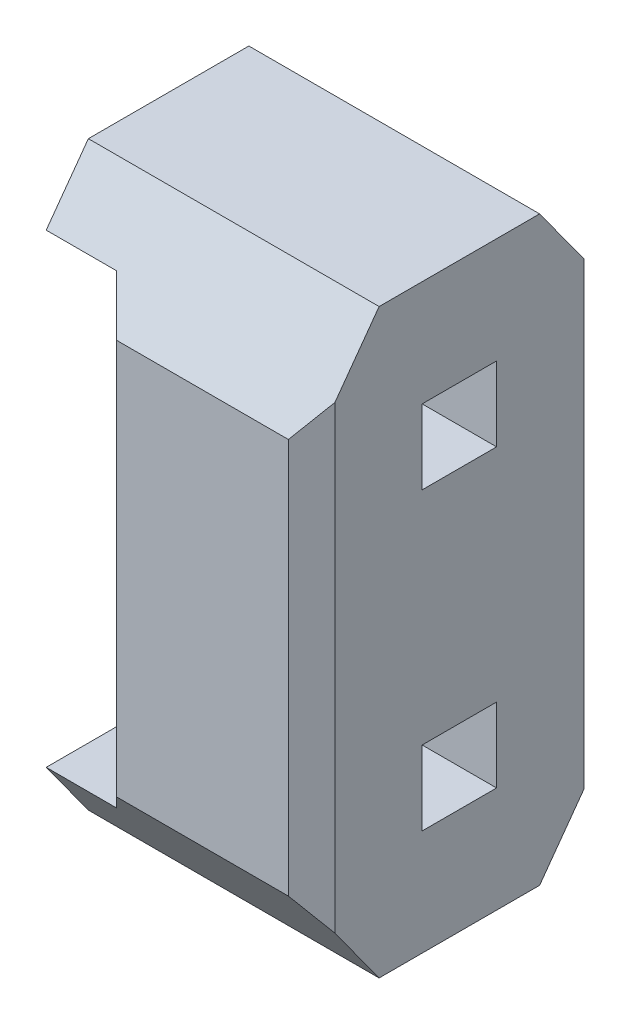
ISO-10303-21;
HEADER;
FILE_DESCRIPTION(('STEP AP214'),'2;1');
FILE_NAME('part.step','',(''),(''),'','','');
FILE_SCHEMA(('AUTOMOTIVE_DESIGN { 1 0 10303 214 1 1 1 1 }'));
ENDSEC;
DATA;
#1=APPLICATION_CONTEXT('core data for automotive mechanical design processes');
#2=APPLICATION_PROTOCOL_DEFINITION('international standard','automotive_design',2000,#1);
#3=PRODUCT_CONTEXT('',#1,'mechanical');
#4=PRODUCT('Part','Part','',(#3));
#5=PRODUCT_RELATED_PRODUCT_CATEGORY('part','',(#4));
#6=PRODUCT_DEFINITION_FORMATION('','',#4);
#7=PRODUCT_DEFINITION_CONTEXT('part definition',#1,'design');
#8=PRODUCT_DEFINITION('design','',#6,#7);
#9=PRODUCT_DEFINITION_SHAPE('','',#8);
#10=(LENGTH_UNIT() NAMED_UNIT(*) SI_UNIT(.MILLI.,.METRE.));
#11=(NAMED_UNIT(*) PLANE_ANGLE_UNIT() SI_UNIT($,.RADIAN.));
#12=(NAMED_UNIT(*) SI_UNIT($,.STERADIAN.) SOLID_ANGLE_UNIT());
#13=UNCERTAINTY_MEASURE_WITH_UNIT(LENGTH_MEASURE(1.E-05),#10,'distance_accuracy_value','');
#14=(GEOMETRIC_REPRESENTATION_CONTEXT(3) GLOBAL_UNCERTAINTY_ASSIGNED_CONTEXT((#13)) GLOBAL_UNIT_ASSIGNED_CONTEXT((#10,
#11,#12)) REPRESENTATION_CONTEXT('',''));
#15=CARTESIAN_POINT('',(0.,0.,0.));
#16=DIRECTION('',(0.,0.,1.));
#17=DIRECTION('',(1.,0.,0.));
#18=AXIS2_PLACEMENT_3D('',#15,#16,#17);
#19=CARTESIAN_POINT('',(1.25,4.6,-46.01));
#20=DIRECTION('',(0.,0.586967571460905,0.809610443394407));
#21=DIRECTION('',(0.,-0.809610443394407,0.586967571460905));
#22=AXIS2_PLACEMENT_3D('',#19,#20,#21);
#23=PLANE('',#22);
#24=DIRECTION('',(1.,0.,0.));
#25=VECTOR('',#24,1.);
#26=CARTESIAN_POINT('',(1.25,4.5,-45.9375));
#27=LINE('',#26,#25);
#28=CARTESIAN_POINT('',(0.,4.5,-45.9375));
#29=VERTEX_POINT('',#28);
#30=CARTESIAN_POINT('',(0.602500000000326,4.5,-45.9375000000001));
#31=VERTEX_POINT('',#30);
#32=EDGE_CURVE('E199',#29,#31,#27,.T.);
#33=ORIENTED_EDGE('',*,*,#32,.T.);
#34=DIRECTION('',(0.50620765634869,-0.698217457033983,0.50620765634961));
#35=VECTOR('',#34,1.);
#36=CARTESIAN_POINT('',(0.6025000000002,4.5,-45.9375));
#37=LINE('',#36,#35);
#38=CARTESIAN_POINT('',(0.819999999999672,4.19999999999999,-45.7199999999999));
#39=VERTEX_POINT('',#38);
#40=EDGE_CURVE('E197',#31,#39,#37,.T.);
#41=ORIENTED_EDGE('',*,*,#40,.T.);
#42=DIRECTION('',(1.,0.,0.));
#43=VECTOR('',#42,1.);
#44=CARTESIAN_POINT('',(1.25,4.19999999999999,-45.72));
#45=LINE('',#44,#43);
#46=CARTESIAN_POINT('',(2.30000000000012,4.19999999999999,-45.7199999999999));
#47=VERTEX_POINT('',#46);
#48=EDGE_CURVE('E20',#39,#47,#45,.T.);
#49=ORIENTED_EDGE('',*,*,#48,.T.);
#50=DIRECTION('',(0.506207656348947,0.69821745703386,-0.506207656349523));
#51=VECTOR('',#50,1.);
#52=CARTESIAN_POINT('',(2.3,4.19999999999999,-45.72));
#53=LINE('',#52,#51);
#54=CARTESIAN_POINT('',(2.49999999999988,4.47586206896592,-45.9200000000002));
#55=VERTEX_POINT('',#54);
#56=EDGE_CURVE('E181',#47,#55,#53,.T.);
#57=ORIENTED_EDGE('',*,*,#56,.T.);
#58=DIRECTION('',(0.,-0.809610443394407,0.586967571460905));
#59=VECTOR('',#58,1.);
#60=CARTESIAN_POINT('',(2.5,4.6,-46.01));
#61=LINE('',#60,#59);
#62=CARTESIAN_POINT('',(2.5,5.,-46.3));
#63=VERTEX_POINT('',#62);
#64=EDGE_CURVE('E188',#55,#63,#61,.F.);
#65=ORIENTED_EDGE('',*,*,#64,.T.);
#66=DIRECTION('',(1.,0.,0.));
#67=VECTOR('',#66,1.);
#68=CARTESIAN_POINT('',(1.25,5.,-46.3));
#69=LINE('',#68,#67);
#70=CARTESIAN_POINT('',(0.,5.,-46.3));
#71=VERTEX_POINT('',#70);
#72=EDGE_CURVE('E215',#71,#63,#69,.T.);
#73=ORIENTED_EDGE('',*,*,#72,.F.);
#74=DIRECTION('',(0.,-0.809610443394407,0.586967571460905));
#75=VECTOR('',#74,1.);
#76=CARTESIAN_POINT('',(0.,4.6,-46.01));
#77=LINE('',#76,#75);
#78=EDGE_CURVE('E207',#71,#29,#77,.T.);
#79=ORIENTED_EDGE('',*,*,#78,.T.);
#80=EDGE_LOOP('',(#33,#41,#49,#57,#65,#73,#79));
#81=FACE_BOUND('',#80,.T.);
#82=ADVANCED_FACE('F17',(#81),#23,.T.);
#83=CARTESIAN_POINT('',(1.25,4.6,-47.97));
#84=DIRECTION('',(0.,-0.586967571460905,0.809610443394407));
#85=DIRECTION('',(0.,-0.809610443394407,-0.586967571460905));
#86=AXIS2_PLACEMENT_3D('',#83,#84,#85);
#87=PLANE('',#86);
#88=DIRECTION('',(0.,-0.809610443394407,-0.586967571460905));
#89=VECTOR('',#88,1.);
#90=CARTESIAN_POINT('',(0.,4.6,-47.97));
#91=LINE('',#90,#89);
#92=CARTESIAN_POINT('',(0.,5.,-47.68));
#93=VERTEX_POINT('',#92);
#94=CARTESIAN_POINT('',(0.,4.5,-48.0425));
#95=VERTEX_POINT('',#94);
#96=EDGE_CURVE('E263',#93,#95,#91,.T.);
#97=ORIENTED_EDGE('',*,*,#96,.F.);
#98=DIRECTION('',(1.,0.,0.));
#99=VECTOR('',#98,1.);
#100=CARTESIAN_POINT('',(1.25,5.,-47.68));
#101=LINE('',#100,#99);
#102=CARTESIAN_POINT('',(2.5,5.,-47.68));
#103=VERTEX_POINT('',#102);
#104=EDGE_CURVE('E227',#103,#93,#101,.F.);
#105=ORIENTED_EDGE('',*,*,#104,.F.);
#106=DIRECTION('',(0.,-0.809610443394407,-0.586967571460905));
#107=VECTOR('',#106,1.);
#108=CARTESIAN_POINT('',(2.5,4.6,-47.97));
#109=LINE('',#108,#107);
#110=CARTESIAN_POINT('',(2.49999999999988,4.47586206896591,-48.0599999999998));
#111=VERTEX_POINT('',#110);
#112=EDGE_CURVE('E223',#111,#103,#109,.F.);
#113=ORIENTED_EDGE('',*,*,#112,.F.);
#114=DIRECTION('',(0.506207656348966,0.698217457033858,0.506207656349507));
#115=VECTOR('',#114,1.);
#116=CARTESIAN_POINT('',(2.3,4.19999999999999,-48.26));
#117=LINE('',#116,#115);
#118=CARTESIAN_POINT('',(2.30000000000012,4.2,-48.2600000000001));
#119=VERTEX_POINT('',#118);
#120=EDGE_CURVE('E266',#119,#111,#117,.T.);
#121=ORIENTED_EDGE('',*,*,#120,.F.);
#122=DIRECTION('',(1.,0.,0.));
#123=VECTOR('',#122,1.);
#124=CARTESIAN_POINT('',(1.25,4.19999999999999,-48.26));
#125=LINE('',#124,#123);
#126=CARTESIAN_POINT('',(0.819999999999671,4.2,-48.2600000000001));
#127=VERTEX_POINT('',#126);
#128=EDGE_CURVE('E205',#127,#119,#125,.T.);
#129=ORIENTED_EDGE('',*,*,#128,.F.);
#130=DIRECTION('',(0.506207656348697,-0.698217457033984,-0.506207656349602));
#131=VECTOR('',#130,1.);
#132=CARTESIAN_POINT('',(0.6025000000002,4.5,-48.0425));
#133=LINE('',#132,#131);
#134=CARTESIAN_POINT('',(0.602500000000324,4.5,-48.0424999999999));
#135=VERTEX_POINT('',#134);
#136=EDGE_CURVE('E203',#135,#127,#133,.T.);
#137=ORIENTED_EDGE('',*,*,#136,.F.);
#138=DIRECTION('',(1.,0.,0.));
#139=VECTOR('',#138,1.);
#140=CARTESIAN_POINT('',(1.25,4.5,-48.0425));
#141=LINE('',#140,#139);
#142=EDGE_CURVE('E261',#95,#135,#141,.T.);
#143=ORIENTED_EDGE('',*,*,#142,.F.);
#144=EDGE_LOOP('',(#97,#105,#113,#121,#129,#137,#143));
#145=FACE_BOUND('',#144,.T.);
#146=ADVANCED_FACE('F285',(#145),#87,.F.);
#147=CARTESIAN_POINT('',(1.25,0.4,-47.97));
#148=DIRECTION('',(0.,0.586967571460905,0.809610443394407));
#149=DIRECTION('',(0.,-0.809610443394407,0.586967571460905));
#150=AXIS2_PLACEMENT_3D('',#147,#148,#149);
#151=PLANE('',#150);
#152=DIRECTION('',(-0.506207656349411,0.698217457033645,-0.506207656349355));
#153=VECTOR('',#152,1.);
#154=CARTESIAN_POINT('',(2.5,0.5241379310345,-48.06));
#155=LINE('',#154,#153);
#156=CARTESIAN_POINT('',(2.49999999999988,0.5241379310345,-48.0599999999999));
#157=VERTEX_POINT('',#156);
#158=CARTESIAN_POINT('',(2.30000000000012,0.800000000000004,-48.2600000000001));
#159=VERTEX_POINT('',#158);
#160=EDGE_CURVE('E251',#157,#159,#155,.T.);
#161=ORIENTED_EDGE('',*,*,#160,.F.);
#162=DIRECTION('',(0.,-0.809610443394407,0.586967571460905));
#163=VECTOR('',#162,1.);
#164=CARTESIAN_POINT('',(2.5,0.4,-47.97));
#165=LINE('',#164,#163);
#166=CARTESIAN_POINT('',(2.5,0.,-47.68));
#167=VERTEX_POINT('',#166);
#168=EDGE_CURVE('E253',#167,#157,#165,.F.);
#169=ORIENTED_EDGE('',*,*,#168,.F.);
#170=DIRECTION('',(1.,0.,0.));
#171=VECTOR('',#170,1.);
#172=CARTESIAN_POINT('',(1.25,0.,-47.68));
#173=LINE('',#172,#171);
#174=CARTESIAN_POINT('',(0.,0.,-47.68));
#175=VERTEX_POINT('',#174);
#176=EDGE_CURVE('E288',#167,#175,#173,.F.);
#177=ORIENTED_EDGE('',*,*,#176,.T.);
#178=DIRECTION('',(0.,-0.809610443394407,0.586967571460905));
#179=VECTOR('',#178,1.);
#180=CARTESIAN_POINT('',(0.,0.4,-47.97));
#181=LINE('',#180,#179);
#182=CARTESIAN_POINT('',(0.,0.5,-48.0425));
#183=VERTEX_POINT('',#182);
#184=EDGE_CURVE('E255',#183,#175,#181,.T.);
#185=ORIENTED_EDGE('',*,*,#184,.F.);
#186=DIRECTION('',(1.,0.,0.));
#187=VECTOR('',#186,1.);
#188=CARTESIAN_POINT('',(1.25,0.500000000000001,-48.0425));
#189=LINE('',#188,#187);
#190=CARTESIAN_POINT('',(0.602500000000324,0.5,-48.0424999999999));
#191=VERTEX_POINT('',#190);
#192=EDGE_CURVE('E257',#191,#183,#189,.F.);
#193=ORIENTED_EDGE('',*,*,#192,.F.);
#194=DIRECTION('',(-0.506207656348696,-0.698217457033985,0.506207656349601));
#195=VECTOR('',#194,1.);
#196=CARTESIAN_POINT('',(0.8199999999998,0.800000000000008,-48.26));
#197=LINE('',#196,#195);
#198=CARTESIAN_POINT('',(0.819999999999671,0.800000000000004,-48.2600000000001));
#199=VERTEX_POINT('',#198);
#200=EDGE_CURVE('E259',#199,#191,#197,.T.);
#201=ORIENTED_EDGE('',*,*,#200,.F.);
#202=DIRECTION('',(1.,0.,0.));
#203=VECTOR('',#202,1.);
#204=CARTESIAN_POINT('',(1.25,0.800000000000008,-48.26));
#205=LINE('',#204,#203);
#206=EDGE_CURVE('E249',#159,#199,#205,.F.);
#207=ORIENTED_EDGE('',*,*,#206,.F.);
#208=EDGE_LOOP('',(#161,#169,#177,#185,#193,#201,#207));
#209=FACE_BOUND('',#208,.T.);
#210=ADVANCED_FACE('F431',(#209),#151,.F.);
#211=CARTESIAN_POINT('',(1.25,0.4,-46.01));
#212=DIRECTION('',(0.,-0.586967571460905,0.809610443394407));
#213=DIRECTION('',(0.,-0.809610443394407,-0.586967571460905));
#214=AXIS2_PLACEMENT_3D('',#211,#212,#213);
#215=PLANE('',#214);
#216=DIRECTION('',(1.,0.,0.));
#217=VECTOR('',#216,1.);
#218=CARTESIAN_POINT('',(1.25,0.800000000000013,-45.72));
#219=LINE('',#218,#217);
#220=CARTESIAN_POINT('',(2.30000000000012,0.800000000000006,-45.7199999999999));
#221=VERTEX_POINT('',#220);
#222=CARTESIAN_POINT('',(0.819999999999672,0.800000000000007,-45.7199999999999));
#223=VERTEX_POINT('',#222);
#224=EDGE_CURVE('E191',#221,#223,#219,.F.);
#225=ORIENTED_EDGE('',*,*,#224,.T.);
#226=DIRECTION('',(-0.50620765634869,-0.698217457033983,-0.50620765634961));
#227=VECTOR('',#226,1.);
#228=CARTESIAN_POINT('',(0.8199999999998,0.800000000000013,-45.72));
#229=LINE('',#228,#227);
#230=CARTESIAN_POINT('',(0.602500000000326,0.500000000000002,-45.9375000000001));
#231=VERTEX_POINT('',#230);
#232=EDGE_CURVE('E232',#223,#231,#229,.T.);
#233=ORIENTED_EDGE('',*,*,#232,.T.);
#234=DIRECTION('',(1.,0.,0.));
#235=VECTOR('',#234,1.);
#236=CARTESIAN_POINT('',(1.25,0.500000000000003,-45.9375));
#237=LINE('',#236,#235);
#238=CARTESIAN_POINT('',(0.,0.500000000000001,-45.9375));
#239=VERTEX_POINT('',#238);
#240=EDGE_CURVE('E246',#231,#239,#237,.F.);
#241=ORIENTED_EDGE('',*,*,#240,.T.);
#242=DIRECTION('',(0.,-0.809610443394407,-0.586967571460905));
#243=VECTOR('',#242,1.);
#244=CARTESIAN_POINT('',(0.,0.4,-46.01));
#245=LINE('',#244,#243);
#246=CARTESIAN_POINT('',(0.,0.,-46.3));
#247=VERTEX_POINT('',#246);
#248=EDGE_CURVE('E244',#239,#247,#245,.T.);
#249=ORIENTED_EDGE('',*,*,#248,.T.);
#250=DIRECTION('',(1.,0.,0.));
#251=VECTOR('',#250,1.);
#252=CARTESIAN_POINT('',(1.25,0.,-46.3));
#253=LINE('',#252,#251);
#254=CARTESIAN_POINT('',(2.5,0.,-46.3));
#255=VERTEX_POINT('',#254);
#256=EDGE_CURVE('E293',#247,#255,#253,.T.);
#257=ORIENTED_EDGE('',*,*,#256,.T.);
#258=DIRECTION('',(0.,-0.809610443394407,-0.586967571460905));
#259=VECTOR('',#258,1.);
#260=CARTESIAN_POINT('',(2.5,0.4,-46.01));
#261=LINE('',#260,#259);
#262=CARTESIAN_POINT('',(2.49999999999988,0.524137931034499,-45.9200000000001));
#263=VERTEX_POINT('',#262);
#264=EDGE_CURVE('E241',#255,#263,#261,.F.);
#265=ORIENTED_EDGE('',*,*,#264,.T.);
#266=DIRECTION('',(-0.5062076563494,0.698217457033649,0.506207656349361));
#267=VECTOR('',#266,1.);
#268=CARTESIAN_POINT('',(2.5,0.524137931034498,-45.92));
#269=LINE('',#268,#267);
#270=EDGE_CURVE('E239',#263,#221,#269,.T.);
#271=ORIENTED_EDGE('',*,*,#270,.T.);
#272=EDGE_LOOP('',(#225,#233,#241,#249,#257,#265,#271));
#273=FACE_BOUND('',#272,.T.);
#274=ADVANCED_FACE('F421',(#273),#215,.T.);
#275=CARTESIAN_POINT('',(1.25,5.,-46.99));
#276=DIRECTION('',(0.,1.,0.));
#277=DIRECTION('',(0.,0.,1.));
#278=AXIS2_PLACEMENT_3D('',#275,#276,#277);
#279=PLANE('',#278);
#280=ORIENTED_EDGE('',*,*,#104,.T.);
#281=DIRECTION('',(0.,0.,-1.));
#282=VECTOR('',#281,1.);
#283=CARTESIAN_POINT('',(0.,5.,-46.99));
#284=LINE('',#283,#282);
#285=EDGE_CURVE('E231',#93,#71,#284,.F.);
#286=ORIENTED_EDGE('',*,*,#285,.T.);
#287=ORIENTED_EDGE('',*,*,#72,.T.);
#288=DIRECTION('',(0.,0.,1.));
#289=VECTOR('',#288,1.);
#290=CARTESIAN_POINT('',(2.5,5.,-46.99));
#291=LINE('',#290,#289);
#292=EDGE_CURVE('E219',#63,#103,#291,.F.);
#293=ORIENTED_EDGE('',*,*,#292,.T.);
#294=EDGE_LOOP('',(#280,#286,#287,#293));
#295=FACE_BOUND('',#294,.T.);
#296=ADVANCED_FACE('F229',(#295),#279,.T.);
#297=CARTESIAN_POINT('',(1.25,0.,-46.99));
#298=DIRECTION('',(0.,1.,0.));
#299=DIRECTION('',(0.,0.,1.));
#300=AXIS2_PLACEMENT_3D('',#297,#298,#299);
#301=PLANE('',#300);
#302=DIRECTION('',(0.,0.,-1.));
#303=VECTOR('',#302,1.);
#304=CARTESIAN_POINT('',(0.,0.,-46.99));
#305=LINE('',#304,#303);
#306=EDGE_CURVE('E297',#247,#175,#305,.T.);
#307=ORIENTED_EDGE('',*,*,#306,.T.);
#308=ORIENTED_EDGE('',*,*,#176,.F.);
#309=DIRECTION('',(0.,0.,1.));
#310=VECTOR('',#309,1.);
#311=CARTESIAN_POINT('',(2.5,0.,-46.99));
#312=LINE('',#311,#310);
#313=EDGE_CURVE('E287',#255,#167,#312,.F.);
#314=ORIENTED_EDGE('',*,*,#313,.F.);
#315=ORIENTED_EDGE('',*,*,#256,.F.);
#316=EDGE_LOOP('',(#307,#308,#314,#315));
#317=FACE_BOUND('',#316,.T.);
#318=ADVANCED_FACE('F428',(#317),#301,.F.);
#319=CARTESIAN_POINT('',(0.,4.75,-46.99));
#320=DIRECTION('',(1.,0.,0.));
#321=DIRECTION('',(0.,0.,-1.));
#322=AXIS2_PLACEMENT_3D('',#319,#320,#321);
#323=PLANE('',#322);
#324=ORIENTED_EDGE('',*,*,#285,.F.);
#325=ORIENTED_EDGE('',*,*,#96,.T.);
#326=DIRECTION('',(0.,0.,1.));
#327=VECTOR('',#326,1.);
#328=CARTESIAN_POINT('',(0.,4.5,-46.99));
#329=LINE('',#328,#327);
#330=EDGE_CURVE('E307',#95,#29,#329,.T.);
#331=ORIENTED_EDGE('',*,*,#330,.T.);
#332=ORIENTED_EDGE('',*,*,#78,.F.);
#333=EDGE_LOOP('',(#324,#325,#331,#332));
#334=FACE_BOUND('',#333,.T.);
#335=ADVANCED_FACE('F441',(#334),#323,.F.);
#336=CARTESIAN_POINT('',(0.,0.25,-46.99));
#337=DIRECTION('',(1.,0.,0.));
#338=DIRECTION('',(0.,0.,-1.));
#339=AXIS2_PLACEMENT_3D('',#336,#337,#338);
#340=PLANE('',#339);
#341=ORIENTED_EDGE('',*,*,#306,.F.);
#342=ORIENTED_EDGE('',*,*,#248,.F.);
#343=DIRECTION('',(0.,0.,1.));
#344=VECTOR('',#343,1.);
#345=CARTESIAN_POINT('',(0.,0.5,-46.99));
#346=LINE('',#345,#344);
#347=EDGE_CURVE('E315',#183,#239,#346,.T.);
#348=ORIENTED_EDGE('',*,*,#347,.F.);
#349=ORIENTED_EDGE('',*,*,#184,.T.);
#350=EDGE_LOOP('',(#341,#342,#348,#349));
#351=FACE_BOUND('',#350,.T.);
#352=ADVANCED_FACE('F443',(#351),#340,.F.);
#353=CARTESIAN_POINT('',(1.55,3.45,-46.99));
#354=DIRECTION('',(0.,1.,0.));
#355=DIRECTION('',(0.,0.,1.));
#356=AXIS2_PLACEMENT_3D('',#353,#354,#355);
#357=PLANE('',#356);
#358=DIRECTION('',(1.,0.,0.));
#359=VECTOR('',#358,1.);
#360=CARTESIAN_POINT('',(1.55,3.45,-47.31));
#361=LINE('',#360,#359);
#362=CARTESIAN_POINT('',(0.6,3.45,-47.31));
#363=VERTEX_POINT('',#362);
#364=CARTESIAN_POINT('',(2.5,3.45,-47.31));
#365=VERTEX_POINT('',#364);
#366=EDGE_CURVE('E332',#363,#365,#361,.T.);
#367=ORIENTED_EDGE('',*,*,#366,.F.);
#368=DIRECTION('',(0.,0.,1.));
#369=VECTOR('',#368,1.);
#370=CARTESIAN_POINT('',(0.6,3.45,-46.99));
#371=LINE('',#370,#369);
#372=CARTESIAN_POINT('',(0.6,3.45,-46.67));
#373=VERTEX_POINT('',#372);
#374=EDGE_CURVE('E302',#363,#373,#371,.T.);
#375=ORIENTED_EDGE('',*,*,#374,.T.);
#376=DIRECTION('',(1.,0.,0.));
#377=VECTOR('',#376,1.);
#378=CARTESIAN_POINT('',(1.55,3.45,-46.67));
#379=LINE('',#378,#377);
#380=CARTESIAN_POINT('',(2.5,3.45,-46.67));
#381=VERTEX_POINT('',#380);
#382=EDGE_CURVE('E327',#373,#381,#379,.T.);
#383=ORIENTED_EDGE('',*,*,#382,.T.);
#384=DIRECTION('',(0.,0.,1.));
#385=VECTOR('',#384,1.);
#386=CARTESIAN_POINT('',(2.5,3.45,-46.99));
#387=LINE('',#386,#385);
#388=EDGE_CURVE('E300',#381,#365,#387,.F.);
#389=ORIENTED_EDGE('',*,*,#388,.T.);
#390=EDGE_LOOP('',(#367,#375,#383,#389));
#391=FACE_BOUND('',#390,.T.);
#392=ADVANCED_FACE('F398',(#391),#357,.T.);
#393=CARTESIAN_POINT('',(0.71,2.5,-48.15));
#394=DIRECTION('',(0.707106781190498,0.,0.707106781182598));
#395=DIRECTION('',(0.707106781182598,0.,-0.707106781190498));
#396=AXIS2_PLACEMENT_3D('',#393,#394,#395);
#397=PLANE('',#396);
#398=ORIENTED_EDGE('',*,*,#200,.T.);
#399=DIRECTION('',(0.707106781187161,0.,-0.707106781185934));
#400=VECTOR('',#399,1.);
#401=CARTESIAN_POINT('',(0.6000000000002,0.5,-48.04));
#402=LINE('',#401,#400);
#403=CARTESIAN_POINT('',(0.600000000000408,0.5,-48.0399999999997));
#404=VERTEX_POINT('',#403);
#405=EDGE_CURVE('E312',#404,#191,#402,.T.);
#406=ORIENTED_EDGE('',*,*,#405,.F.);
#407=DIRECTION('',(0.,1.,0.));
#408=VECTOR('',#407,1.);
#409=CARTESIAN_POINT('',(0.6,2.5,-48.04));
#410=LINE('',#409,#408);
#411=CARTESIAN_POINT('',(0.600000000000408,4.5,-48.0399999999997));
#412=VERTEX_POINT('',#411);
#413=EDGE_CURVE('E337',#404,#412,#410,.T.);
#414=ORIENTED_EDGE('',*,*,#413,.T.);
#415=DIRECTION('',(0.707106781187161,0.,-0.707106781185934));
#416=VECTOR('',#415,1.);
#417=CARTESIAN_POINT('',(0.6000000000002,4.5,-48.04));
#418=LINE('',#417,#416);
#419=EDGE_CURVE('E304',#412,#135,#418,.T.);
#420=ORIENTED_EDGE('',*,*,#419,.T.);
#421=ORIENTED_EDGE('',*,*,#136,.T.);
#422=DIRECTION('',(0.,1.,0.));
#423=VECTOR('',#422,1.);
#424=CARTESIAN_POINT('',(0.8199999999998,2.5,-48.26));
#425=LINE('',#424,#423);
#426=EDGE_CURVE('E275',#127,#199,#425,.F.);
#427=ORIENTED_EDGE('',*,*,#426,.T.);
#428=EDGE_LOOP('',(#398,#406,#414,#420,#421,#427));
#429=FACE_BOUND('',#428,.T.);
#430=ADVANCED_FACE('F435',(#429),#397,.F.);
#431=CARTESIAN_POINT('',(0.30125,4.5,-46.99));
#432=DIRECTION('',(0.,1.,0.));
#433=DIRECTION('',(0.,0.,1.));
#434=AXIS2_PLACEMENT_3D('',#431,#432,#433);
#435=PLANE('',#434);
#436=ORIENTED_EDGE('',*,*,#142,.T.);
#437=ORIENTED_EDGE('',*,*,#419,.F.);
#438=DIRECTION('',(0.,0.,-1.));
#439=VECTOR('',#438,1.);
#440=CARTESIAN_POINT('',(0.6,4.5,-46.99));
#441=LINE('',#440,#439);
#442=CARTESIAN_POINT('',(0.600000000000279,4.5,-45.9400000000001));
#443=VERTEX_POINT('',#442);
#444=EDGE_CURVE('E339',#412,#443,#441,.F.);
#445=ORIENTED_EDGE('',*,*,#444,.T.);
#446=DIRECTION('',(-0.707106781182598,0.,-0.707106781190498));
#447=VECTOR('',#446,1.);
#448=CARTESIAN_POINT('',(0.71,4.5,-45.83));
#449=LINE('',#448,#447);
#450=EDGE_CURVE('E310',#443,#31,#449,.F.);
#451=ORIENTED_EDGE('',*,*,#450,.T.);
#452=ORIENTED_EDGE('',*,*,#32,.F.);
#453=ORIENTED_EDGE('',*,*,#330,.F.);
#454=EDGE_LOOP('',(#436,#437,#445,#451,#452,#453));
#455=FACE_BOUND('',#454,.T.);
#456=ADVANCED_FACE('F439',(#455),#435,.F.);
#457=CARTESIAN_POINT('',(0.71,2.5,-45.83));
#458=DIRECTION('',(0.707106781190498,0.,-0.707106781182598));
#459=DIRECTION('',(-0.707106781182598,0.,-0.707106781190498));
#460=AXIS2_PLACEMENT_3D('',#457,#458,#459);
#461=PLANE('',#460);
#462=ORIENTED_EDGE('',*,*,#232,.F.);
#463=DIRECTION('',(0.,1.,0.));
#464=VECTOR('',#463,1.);
#465=CARTESIAN_POINT('',(0.8199999999998,2.5,-45.72));
#466=LINE('',#465,#464);
#467=EDGE_CURVE('E325',#39,#223,#466,.F.);
#468=ORIENTED_EDGE('',*,*,#467,.F.);
#469=ORIENTED_EDGE('',*,*,#40,.F.);
#470=ORIENTED_EDGE('',*,*,#450,.F.);
#471=DIRECTION('',(0.,1.,0.));
#472=VECTOR('',#471,1.);
#473=CARTESIAN_POINT('',(0.6,2.5,-45.94));
#474=LINE('',#473,#472);
#475=CARTESIAN_POINT('',(0.600000000000408,0.5,-45.9400000000003));
#476=VERTEX_POINT('',#475);
#477=EDGE_CURVE('E341',#443,#476,#474,.F.);
#478=ORIENTED_EDGE('',*,*,#477,.T.);
#479=DIRECTION('',(-0.70710678118618,0.,-0.707106781186916));
#480=VECTOR('',#479,1.);
#481=CARTESIAN_POINT('',(0.6025000000002,0.5,-45.9375));
#482=LINE('',#481,#480);
#483=EDGE_CURVE('E318',#231,#476,#482,.T.);
#484=ORIENTED_EDGE('',*,*,#483,.F.);
#485=EDGE_LOOP('',(#462,#468,#469,#470,#478,#484));
#486=FACE_BOUND('',#485,.T.);
#487=ADVANCED_FACE('F416',(#486),#461,.F.);
#488=CARTESIAN_POINT('',(0.30125,0.5,-46.99));
#489=DIRECTION('',(0.,1.,0.));
#490=DIRECTION('',(0.,0.,1.));
#491=AXIS2_PLACEMENT_3D('',#488,#489,#490);
#492=PLANE('',#491);
#493=ORIENTED_EDGE('',*,*,#483,.T.);
#494=DIRECTION('',(0.,0.,-1.));
#495=VECTOR('',#494,1.);
#496=CARTESIAN_POINT('',(0.6,0.5,-46.99));
#497=LINE('',#496,#495);
#498=EDGE_CURVE('E343',#476,#404,#497,.T.);
#499=ORIENTED_EDGE('',*,*,#498,.T.);
#500=ORIENTED_EDGE('',*,*,#405,.T.);
#501=ORIENTED_EDGE('',*,*,#192,.T.);
#502=ORIENTED_EDGE('',*,*,#347,.T.);
#503=ORIENTED_EDGE('',*,*,#240,.F.);
#504=EDGE_LOOP('',(#493,#499,#500,#501,#502,#503));
#505=FACE_BOUND('',#504,.T.);
#506=ADVANCED_FACE('F418',(#505),#492,.T.);
#507=CARTESIAN_POINT('',(1.55,1.23,-47.31));
#508=DIRECTION('',(0.,0.,1.));
#509=DIRECTION('',(1.,0.,0.));
#510=AXIS2_PLACEMENT_3D('',#507,#508,#509);
#511=PLANE('',#510);
#512=DIRECTION('',(1.,0.,0.));
#513=VECTOR('',#512,1.);
#514=CARTESIAN_POINT('',(1.55,1.55,-47.31));
#515=LINE('',#514,#513);
#516=CARTESIAN_POINT('',(2.5,1.55,-47.31));
#517=VERTEX_POINT('',#516);
#518=CARTESIAN_POINT('',(0.6,1.55,-47.31));
#519=VERTEX_POINT('',#518);
#520=EDGE_CURVE('E283',#517,#519,#515,.F.);
#521=ORIENTED_EDGE('',*,*,#520,.T.);
#522=DIRECTION('',(0.,1.,0.));
#523=VECTOR('',#522,1.);
#524=CARTESIAN_POINT('',(0.6,2.5,-47.31));
#525=LINE('',#524,#523);
#526=CARTESIAN_POINT('',(0.6,0.91,-47.31));
#527=VERTEX_POINT('',#526);
#528=EDGE_CURVE('E346',#519,#527,#525,.F.);
#529=ORIENTED_EDGE('',*,*,#528,.T.);
#530=DIRECTION('',(1.,0.,0.));
#531=VECTOR('',#530,1.);
#532=CARTESIAN_POINT('',(1.55,0.91,-47.31));
#533=LINE('',#532,#531);
#534=CARTESIAN_POINT('',(2.5,0.91,-47.31));
#535=VERTEX_POINT('',#534);
#536=EDGE_CURVE('E354',#535,#527,#533,.F.);
#537=ORIENTED_EDGE('',*,*,#536,.F.);
#538=DIRECTION('',(0.,1.,0.));
#539=VECTOR('',#538,1.);
#540=CARTESIAN_POINT('',(2.5,1.23,-47.31));
#541=LINE('',#540,#539);
#542=EDGE_CURVE('E321',#535,#517,#541,.T.);
#543=ORIENTED_EDGE('',*,*,#542,.T.);
#544=EDGE_LOOP('',(#521,#529,#537,#543));
#545=FACE_BOUND('',#544,.T.);
#546=ADVANCED_FACE('F483',(#545),#511,.T.);
#547=CARTESIAN_POINT('',(1.56,2.5,-48.26));
#548=DIRECTION('',(0.,0.,1.));
#549=DIRECTION('',(1.,0.,0.));
#550=AXIS2_PLACEMENT_3D('',#547,#548,#549);
#551=PLANE('',#550);
#552=DIRECTION('',(0.,1.,0.));
#553=VECTOR('',#552,1.);
#554=CARTESIAN_POINT('',(2.30000000000047,2.5,-48.2600000000005));
#555=LINE('',#554,#553);
#556=EDGE_CURVE('E193',#159,#119,#555,.T.);
#557=ORIENTED_EDGE('',*,*,#556,.F.);
#558=ORIENTED_EDGE('',*,*,#206,.T.);
#559=ORIENTED_EDGE('',*,*,#426,.F.);
#560=ORIENTED_EDGE('',*,*,#128,.T.);
#561=EDGE_LOOP('',(#557,#558,#559,#560));
#562=FACE_BOUND('',#561,.T.);
#563=ADVANCED_FACE('F272',(#562),#551,.F.);
#564=CARTESIAN_POINT('',(1.56,2.5,-45.72));
#565=DIRECTION('',(0.,0.,1.));
#566=DIRECTION('',(1.,0.,0.));
#567=AXIS2_PLACEMENT_3D('',#564,#565,#566);
#568=PLANE('',#567);
#569=ORIENTED_EDGE('',*,*,#48,.F.);
#570=ORIENTED_EDGE('',*,*,#467,.T.);
#571=ORIENTED_EDGE('',*,*,#224,.F.);
#572=DIRECTION('',(0.,1.,0.));
#573=VECTOR('',#572,1.);
#574=CARTESIAN_POINT('',(2.30000000000047,2.5,-45.7199999999995));
#575=LINE('',#574,#573);
#576=EDGE_CURVE('E183',#47,#221,#575,.F.);
#577=ORIENTED_EDGE('',*,*,#576,.F.);
#578=EDGE_LOOP('',(#569,#570,#571,#577));
#579=FACE_BOUND('',#578,.T.);
#580=ADVANCED_FACE('F189',(#579),#568,.T.);
#581=CARTESIAN_POINT('',(1.55,3.77,-46.67));
#582=DIRECTION('',(0.,0.,1.));
#583=DIRECTION('',(1.,0.,0.));
#584=AXIS2_PLACEMENT_3D('',#581,#582,#583);
#585=PLANE('',#584);
#586=DIRECTION('',(0.,1.,0.));
#587=VECTOR('',#586,1.);
#588=CARTESIAN_POINT('',(2.5,3.77,-46.67));
#589=LINE('',#588,#587);
#590=CARTESIAN_POINT('',(2.5,4.09,-46.67));
#591=VERTEX_POINT('',#590);
#592=EDGE_CURVE('E330',#381,#591,#589,.T.);
#593=ORIENTED_EDGE('',*,*,#592,.F.);
#594=ORIENTED_EDGE('',*,*,#382,.F.);
#595=DIRECTION('',(0.,1.,0.));
#596=VECTOR('',#595,1.);
#597=CARTESIAN_POINT('',(0.6,2.5,-46.67));
#598=LINE('',#597,#596);
#599=CARTESIAN_POINT('',(0.6,4.09,-46.67));
#600=VERTEX_POINT('',#599);
#601=EDGE_CURVE('E351',#373,#600,#598,.T.);
#602=ORIENTED_EDGE('',*,*,#601,.T.);
#603=DIRECTION('',(1.,0.,0.));
#604=VECTOR('',#603,1.);
#605=CARTESIAN_POINT('',(1.55,4.09,-46.67));
#606=LINE('',#605,#604);
#607=EDGE_CURVE('E368',#600,#591,#606,.T.);
#608=ORIENTED_EDGE('',*,*,#607,.T.);
#609=EDGE_LOOP('',(#593,#594,#602,#608));
#610=FACE_BOUND('',#609,.T.);
#611=ADVANCED_FACE('F402',(#610),#585,.F.);
#612=CARTESIAN_POINT('',(1.55,3.77,-47.31));
#613=DIRECTION('',(0.,0.,1.));
#614=DIRECTION('',(1.,0.,0.));
#615=AXIS2_PLACEMENT_3D('',#612,#613,#614);
#616=PLANE('',#615);
#617=DIRECTION('',(1.,0.,0.));
#618=VECTOR('',#617,1.);
#619=CARTESIAN_POINT('',(1.55,4.09,-47.31));
#620=LINE('',#619,#618);
#621=CARTESIAN_POINT('',(2.5,4.09,-47.31));
#622=VERTEX_POINT('',#621);
#623=CARTESIAN_POINT('',(0.6,4.09,-47.31));
#624=VERTEX_POINT('',#623);
#625=EDGE_CURVE('E371',#622,#624,#620,.F.);
#626=ORIENTED_EDGE('',*,*,#625,.T.);
#627=DIRECTION('',(0.,1.,0.));
#628=VECTOR('',#627,1.);
#629=CARTESIAN_POINT('',(0.6,2.5,-47.31));
#630=LINE('',#629,#628);
#631=EDGE_CURVE('E348',#624,#363,#630,.F.);
#632=ORIENTED_EDGE('',*,*,#631,.T.);
#633=ORIENTED_EDGE('',*,*,#366,.T.);
#634=DIRECTION('',(0.,1.,0.));
#635=VECTOR('',#634,1.);
#636=CARTESIAN_POINT('',(2.5,3.77,-47.31));
#637=LINE('',#636,#635);
#638=EDGE_CURVE('E335',#365,#622,#637,.T.);
#639=ORIENTED_EDGE('',*,*,#638,.T.);
#640=EDGE_LOOP('',(#626,#632,#633,#639));
#641=FACE_BOUND('',#640,.T.);
#642=ADVANCED_FACE('F395',(#641),#616,.T.);
#643=CARTESIAN_POINT('',(0.6,2.5,-46.99));
#644=DIRECTION('',(1.,0.,0.));
#645=DIRECTION('',(0.,0.,-1.));
#646=AXIS2_PLACEMENT_3D('',#643,#644,#645);
#647=PLANE('',#646);
#648=ORIENTED_EDGE('',*,*,#374,.F.);
#649=ORIENTED_EDGE('',*,*,#631,.F.);
#650=DIRECTION('',(0.,0.,1.));
#651=VECTOR('',#650,1.);
#652=CARTESIAN_POINT('',(0.6,4.09,-46.99));
#653=LINE('',#652,#651);
#654=EDGE_CURVE('E192',#624,#600,#653,.T.);
#655=ORIENTED_EDGE('',*,*,#654,.T.);
#656=ORIENTED_EDGE('',*,*,#601,.F.);
#657=EDGE_LOOP('',(#648,#649,#655,#656));
#658=FACE_BOUND('',#657,.T.);
#659=ORIENTED_EDGE('',*,*,#528,.F.);
#660=DIRECTION('',(0.,0.,1.));
#661=VECTOR('',#660,1.);
#662=CARTESIAN_POINT('',(0.6,1.55,-46.99));
#663=LINE('',#662,#661);
#664=CARTESIAN_POINT('',(0.6,1.55,-46.67));
#665=VERTEX_POINT('',#664);
#666=EDGE_CURVE('E360',#519,#665,#663,.T.);
#667=ORIENTED_EDGE('',*,*,#666,.T.);
#668=DIRECTION('',(0.,1.,0.));
#669=VECTOR('',#668,1.);
#670=CARTESIAN_POINT('',(0.6,1.23,-46.67));
#671=LINE('',#670,#669);
#672=CARTESIAN_POINT('',(0.6,0.91,-46.67));
#673=VERTEX_POINT('',#672);
#674=EDGE_CURVE('E374',#665,#673,#671,.F.);
#675=ORIENTED_EDGE('',*,*,#674,.T.);
#676=DIRECTION('',(0.,0.,1.));
#677=VECTOR('',#676,1.);
#678=CARTESIAN_POINT('',(0.6,0.91,-46.99));
#679=LINE('',#678,#677);
#680=EDGE_CURVE('E357',#527,#673,#679,.T.);
#681=ORIENTED_EDGE('',*,*,#680,.F.);
#682=EDGE_LOOP('',(#659,#667,#675,#681));
#683=FACE_BOUND('',#682,.T.);
#684=ORIENTED_EDGE('',*,*,#477,.F.);
#685=ORIENTED_EDGE('',*,*,#444,.F.);
#686=ORIENTED_EDGE('',*,*,#413,.F.);
#687=ORIENTED_EDGE('',*,*,#498,.F.);
#688=EDGE_LOOP('',(#684,#685,#686,#687));
#689=FACE_BOUND('',#688,.T.);
#690=ADVANCED_FACE('F404',(#658,#683,#689),#647,.F.);
#691=CARTESIAN_POINT('',(1.55,0.91,-46.99));
#692=DIRECTION('',(0.,1.,0.));
#693=DIRECTION('',(0.,0.,1.));
#694=AXIS2_PLACEMENT_3D('',#691,#692,#693);
#695=PLANE('',#694);
#696=ORIENTED_EDGE('',*,*,#536,.T.);
#697=ORIENTED_EDGE('',*,*,#680,.T.);
#698=DIRECTION('',(1.,0.,0.));
#699=VECTOR('',#698,1.);
#700=CARTESIAN_POINT('',(1.55,0.91,-46.67));
#701=LINE('',#700,#699);
#702=CARTESIAN_POINT('',(2.5,0.91,-46.67));
#703=VERTEX_POINT('',#702);
#704=EDGE_CURVE('E376',#673,#703,#701,.T.);
#705=ORIENTED_EDGE('',*,*,#704,.T.);
#706=DIRECTION('',(0.,0.,1.));
#707=VECTOR('',#706,1.);
#708=CARTESIAN_POINT('',(2.5,0.91,-46.99));
#709=LINE('',#708,#707);
#710=EDGE_CURVE('E34',#703,#535,#709,.F.);
#711=ORIENTED_EDGE('',*,*,#710,.T.);
#712=EDGE_LOOP('',(#696,#697,#705,#711));
#713=FACE_BOUND('',#712,.T.);
#714=ADVANCED_FACE('F407',(#713),#695,.T.);
#715=CARTESIAN_POINT('',(1.55,1.55,-46.99));
#716=DIRECTION('',(0.,1.,0.));
#717=DIRECTION('',(0.,0.,1.));
#718=AXIS2_PLACEMENT_3D('',#715,#716,#717);
#719=PLANE('',#718);
#720=DIRECTION('',(0.,0.,1.));
#721=VECTOR('',#720,1.);
#722=CARTESIAN_POINT('',(2.5,1.55,-46.99));
#723=LINE('',#722,#721);
#724=CARTESIAN_POINT('',(2.5,1.55,-46.67));
#725=VERTEX_POINT('',#724);
#726=EDGE_CURVE('E362',#725,#517,#723,.F.);
#727=ORIENTED_EDGE('',*,*,#726,.F.);
#728=DIRECTION('',(1.,0.,0.));
#729=VECTOR('',#728,1.);
#730=CARTESIAN_POINT('',(1.55,1.55,-46.67));
#731=LINE('',#730,#729);
#732=EDGE_CURVE('E378',#725,#665,#731,.F.);
#733=ORIENTED_EDGE('',*,*,#732,.T.);
#734=ORIENTED_EDGE('',*,*,#666,.F.);
#735=ORIENTED_EDGE('',*,*,#520,.F.);
#736=EDGE_LOOP('',(#727,#733,#734,#735));
#737=FACE_BOUND('',#736,.T.);
#738=ADVANCED_FACE('F468',(#737),#719,.F.);
#739=CARTESIAN_POINT('',(2.4,2.5,-48.16));
#740=DIRECTION('',(0.707106781189898,0.,-0.707106781183198));
#741=DIRECTION('',(-0.707106781183198,0.,-0.707106781189898));
#742=AXIS2_PLACEMENT_3D('',#739,#740,#741);
#743=PLANE('',#742);
#744=DIRECTION('',(0.,1.,0.));
#745=VECTOR('',#744,1.);
#746=CARTESIAN_POINT('',(2.5,2.5,-48.06));
#747=LINE('',#746,#745);
#748=EDGE_CURVE('E381',#157,#111,#747,.T.);
#749=ORIENTED_EDGE('',*,*,#748,.F.);
#750=ORIENTED_EDGE('',*,*,#160,.T.);
#751=ORIENTED_EDGE('',*,*,#556,.T.);
#752=ORIENTED_EDGE('',*,*,#120,.T.);
#753=EDGE_LOOP('',(#749,#750,#751,#752));
#754=FACE_BOUND('',#753,.T.);
#755=ADVANCED_FACE('F281',(#754),#743,.T.);
#756=CARTESIAN_POINT('',(2.4,2.5,-45.82));
#757=DIRECTION('',(0.707106781189898,0.,0.707106781183198));
#758=DIRECTION('',(0.707106781183198,0.,-0.707106781189898));
#759=AXIS2_PLACEMENT_3D('',#756,#757,#758);
#760=PLANE('',#759);
#761=DIRECTION('',(0.,1.,0.));
#762=VECTOR('',#761,1.);
#763=CARTESIAN_POINT('',(2.5,2.5,-45.92));
#764=LINE('',#763,#762);
#765=EDGE_CURVE('E186',#55,#263,#764,.F.);
#766=ORIENTED_EDGE('',*,*,#765,.F.);
#767=ORIENTED_EDGE('',*,*,#56,.F.);
#768=ORIENTED_EDGE('',*,*,#576,.T.);
#769=ORIENTED_EDGE('',*,*,#270,.F.);
#770=EDGE_LOOP('',(#766,#767,#768,#769));
#771=FACE_BOUND('',#770,.T.);
#772=ADVANCED_FACE('F182',(#771),#760,.T.);
#773=CARTESIAN_POINT('',(1.55,4.09,-46.99));
#774=DIRECTION('',(0.,1.,0.));
#775=DIRECTION('',(0.,0.,1.));
#776=AXIS2_PLACEMENT_3D('',#773,#774,#775);
#777=PLANE('',#776);
#778=DIRECTION('',(0.,0.,-1.));
#779=VECTOR('',#778,1.);
#780=CARTESIAN_POINT('',(2.5,4.09,-46.99));
#781=LINE('',#780,#779);
#782=EDGE_CURVE('E26',#591,#622,#781,.T.);
#783=ORIENTED_EDGE('',*,*,#782,.F.);
#784=ORIENTED_EDGE('',*,*,#607,.F.);
#785=ORIENTED_EDGE('',*,*,#654,.F.);
#786=ORIENTED_EDGE('',*,*,#625,.F.);
#787=EDGE_LOOP('',(#783,#784,#785,#786));
#788=FACE_BOUND('',#787,.T.);
#789=ADVANCED_FACE('F392',(#788),#777,.F.);
#790=CARTESIAN_POINT('',(1.55,1.23,-46.67));
#791=DIRECTION('',(0.,0.,1.));
#792=DIRECTION('',(1.,0.,0.));
#793=AXIS2_PLACEMENT_3D('',#790,#791,#792);
#794=PLANE('',#793);
#795=DIRECTION('',(0.,1.,0.));
#796=VECTOR('',#795,1.);
#797=CARTESIAN_POINT('',(2.5,2.5,-46.67));
#798=LINE('',#797,#796);
#799=EDGE_CURVE('E11',#703,#725,#798,.T.);
#800=ORIENTED_EDGE('',*,*,#799,.F.);
#801=ORIENTED_EDGE('',*,*,#704,.F.);
#802=ORIENTED_EDGE('',*,*,#674,.F.);
#803=ORIENTED_EDGE('',*,*,#732,.F.);
#804=EDGE_LOOP('',(#800,#801,#802,#803));
#805=FACE_BOUND('',#804,.T.);
#806=ADVANCED_FACE('F454',(#805),#794,.F.);
#807=CARTESIAN_POINT('',(2.5,2.5,-46.99));
#808=DIRECTION('',(1.,0.,0.));
#809=DIRECTION('',(0.,0.,-1.));
#810=AXIS2_PLACEMENT_3D('',#807,#808,#809);
#811=PLANE('',#810);
#812=ORIENTED_EDGE('',*,*,#710,.F.);
#813=ORIENTED_EDGE('',*,*,#799,.T.);
#814=ORIENTED_EDGE('',*,*,#726,.T.);
#815=ORIENTED_EDGE('',*,*,#542,.F.);
#816=EDGE_LOOP('',(#812,#813,#814,#815));
#817=FACE_BOUND('',#816,.T.);
#818=ORIENTED_EDGE('',*,*,#592,.T.);
#819=ORIENTED_EDGE('',*,*,#782,.T.);
#820=ORIENTED_EDGE('',*,*,#638,.F.);
#821=ORIENTED_EDGE('',*,*,#388,.F.);
#822=EDGE_LOOP('',(#818,#819,#820,#821));
#823=FACE_BOUND('',#822,.T.);
#824=ORIENTED_EDGE('',*,*,#64,.F.);
#825=ORIENTED_EDGE('',*,*,#765,.T.);
#826=ORIENTED_EDGE('',*,*,#264,.F.);
#827=ORIENTED_EDGE('',*,*,#313,.T.);
#828=ORIENTED_EDGE('',*,*,#168,.T.);
#829=ORIENTED_EDGE('',*,*,#748,.T.);
#830=ORIENTED_EDGE('',*,*,#112,.T.);
#831=ORIENTED_EDGE('',*,*,#292,.F.);
#832=EDGE_LOOP('',(#824,#825,#826,#827,#828,#829,#830,#831));
#833=FACE_BOUND('',#832,.T.);
#834=ADVANCED_FACE('F220',(#817,#823,#833),#811,.T.);
#835=CLOSED_SHELL('',(#82,#146,#210,#274,#296,#318,#335,#352,#392,#430,#456,#487,#506,#546,#563,
#580,#611,#642,#690,#714,#738,#755,#772,#789,#806,#834));
#836=MANIFOLD_SOLID_BREP('B1',#835);
#837=ADVANCED_BREP_SHAPE_REPRESENTATION('',(#18,#836),#14);
#838=SHAPE_DEFINITION_REPRESENTATION(#9,#837);
ENDSEC;
END-ISO-10303-21;
